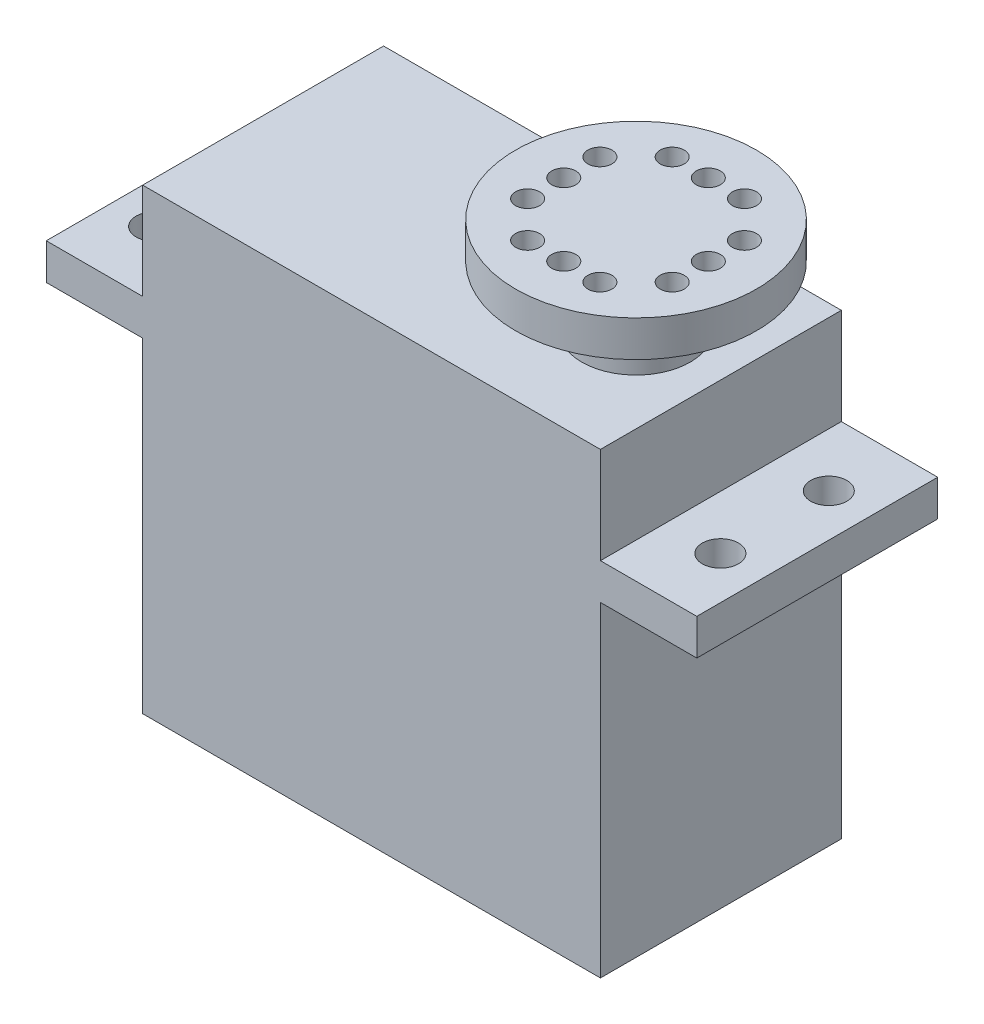
ISO-10303-21;
HEADER;
FILE_DESCRIPTION(('STEP AP214'),'2;1');
FILE_NAME('part.step','',(''),(''),'','','');
FILE_SCHEMA(('AUTOMOTIVE_DESIGN { 1 0 10303 214 1 1 1 1 }'));
ENDSEC;
DATA;
#1=APPLICATION_CONTEXT('core data for automotive mechanical design processes');
#2=APPLICATION_PROTOCOL_DEFINITION('international standard','automotive_design',2000,#1);
#3=PRODUCT_CONTEXT('',#1,'mechanical');
#4=PRODUCT('Part','Part','',(#3));
#5=PRODUCT_RELATED_PRODUCT_CATEGORY('part','',(#4));
#6=PRODUCT_DEFINITION_FORMATION('','',#4);
#7=PRODUCT_DEFINITION_CONTEXT('part definition',#1,'design');
#8=PRODUCT_DEFINITION('design','',#6,#7);
#9=PRODUCT_DEFINITION_SHAPE('','',#8);
#10=(LENGTH_UNIT() NAMED_UNIT(*) SI_UNIT(.MILLI.,.METRE.));
#11=(NAMED_UNIT(*) PLANE_ANGLE_UNIT() SI_UNIT($,.RADIAN.));
#12=(NAMED_UNIT(*) SI_UNIT($,.STERADIAN.) SOLID_ANGLE_UNIT());
#13=UNCERTAINTY_MEASURE_WITH_UNIT(LENGTH_MEASURE(1.E-05),#10,'distance_accuracy_value','');
#14=(GEOMETRIC_REPRESENTATION_CONTEXT(3) GLOBAL_UNCERTAINTY_ASSIGNED_CONTEXT((#13)) GLOBAL_UNIT_ASSIGNED_CONTEXT((#10,
#11,#12)) REPRESENTATION_CONTEXT('',''));
#15=CARTESIAN_POINT('',(0.,0.,0.));
#16=DIRECTION('',(0.,0.,1.));
#17=DIRECTION('',(1.,0.,0.));
#18=AXIS2_PLACEMENT_3D('',#15,#16,#17);
#19=CARTESIAN_POINT('',(38.,0.,20.));
#20=DIRECTION('',(-1.,0.,0.));
#21=DIRECTION('',(0.,0.,1.));
#22=AXIS2_PLACEMENT_3D('',#19,#20,#21);
#23=PLANE('',#22);
#24=DIRECTION('',(0.,1.,0.));
#25=VECTOR('',#24,1.);
#26=CARTESIAN_POINT('',(38.,0.,0.));
#27=LINE('',#26,#25);
#28=CARTESIAN_POINT('',(38.,0.,0.));
#29=VERTEX_POINT('',#28);
#30=CARTESIAN_POINT('',(38.,27.,0.));
#31=VERTEX_POINT('',#30);
#32=EDGE_CURVE('E156',#29,#31,#27,.T.);
#33=ORIENTED_EDGE('',*,*,#32,.T.);
#34=DIRECTION('',(0.,0.,-1.));
#35=VECTOR('',#34,1.);
#36=CARTESIAN_POINT('',(38.,27.,20.));
#37=LINE('',#36,#35);
#38=CARTESIAN_POINT('',(38.,27.,20.));
#39=VERTEX_POINT('',#38);
#40=EDGE_CURVE('E11',#39,#31,#37,.T.);
#41=ORIENTED_EDGE('',*,*,#40,.F.);
#42=DIRECTION('',(0.,1.,0.));
#43=VECTOR('',#42,1.);
#44=CARTESIAN_POINT('',(38.,0.,20.));
#45=LINE('',#44,#43);
#46=CARTESIAN_POINT('',(38.,0.,20.));
#47=VERTEX_POINT('',#46);
#48=EDGE_CURVE('E187',#47,#39,#45,.T.);
#49=ORIENTED_EDGE('',*,*,#48,.F.);
#50=DIRECTION('',(0.,0.,-1.));
#51=VECTOR('',#50,1.);
#52=CARTESIAN_POINT('',(38.,0.,20.));
#53=LINE('',#52,#51);
#54=EDGE_CURVE('E152',#47,#29,#53,.T.);
#55=ORIENTED_EDGE('',*,*,#54,.T.);
#56=EDGE_LOOP('',(#33,#41,#49,#55));
#57=FACE_BOUND('',#56,.T.);
#58=ADVANCED_FACE('F34',(#57),#23,.F.);
#59=CARTESIAN_POINT('',(0.,27.,20.));
#60=DIRECTION('',(0.,1.,0.));
#61=DIRECTION('',(0.,0.,1.));
#62=AXIS2_PLACEMENT_3D('',#59,#60,#61);
#63=PLANE('',#62);
#64=CARTESIAN_POINT('',(42.4562798977896,27.,5.5));
#65=DIRECTION('',(0.,1.,0.));
#66=DIRECTION('',(0.,0.,1.));
#67=AXIS2_PLACEMENT_3D('',#64,#65,#66);
#68=CIRCLE('',#67,1.5);
#69=CARTESIAN_POINT('',(42.4562798977896,27.,7.));
#70=VERTEX_POINT('',#69);
#71=EDGE_CURVE('E222',#70,#70,#68,.T.);
#72=ORIENTED_EDGE('',*,*,#71,.T.);
#73=EDGE_LOOP('',(#72));
#74=FACE_BOUND('',#73,.T.);
#75=CARTESIAN_POINT('',(42.4562798977896,27.,14.5));
#76=DIRECTION('',(0.,1.,0.));
#77=DIRECTION('',(0.,0.,1.));
#78=AXIS2_PLACEMENT_3D('',#75,#76,#77);
#79=CIRCLE('',#78,1.5);
#80=CARTESIAN_POINT('',(42.4562798977896,27.,16.));
#81=VERTEX_POINT('',#80);
#82=EDGE_CURVE('E209',#81,#81,#79,.T.);
#83=ORIENTED_EDGE('',*,*,#82,.T.);
#84=EDGE_LOOP('',(#83));
#85=FACE_BOUND('',#84,.T.);
#86=DIRECTION('',(1.,0.,0.));
#87=VECTOR('',#86,1.);
#88=CARTESIAN_POINT('',(0.,27.,0.));
#89=LINE('',#88,#87);
#90=CARTESIAN_POINT('',(46.,27.,0.));
#91=VERTEX_POINT('',#90);
#92=EDGE_CURVE('E159',#31,#91,#89,.T.);
#93=ORIENTED_EDGE('',*,*,#92,.T.);
#94=DIRECTION('',(0.,0.,-1.));
#95=VECTOR('',#94,1.);
#96=CARTESIAN_POINT('',(46.,27.,20.));
#97=LINE('',#96,#95);
#98=CARTESIAN_POINT('',(46.,27.,20.));
#99=VERTEX_POINT('',#98);
#100=EDGE_CURVE('E43',#99,#91,#97,.T.);
#101=ORIENTED_EDGE('',*,*,#100,.F.);
#102=DIRECTION('',(1.,0.,0.));
#103=VECTOR('',#102,1.);
#104=CARTESIAN_POINT('',(0.,27.,20.));
#105=LINE('',#104,#103);
#106=EDGE_CURVE('E103',#39,#99,#105,.T.);
#107=ORIENTED_EDGE('',*,*,#106,.F.);
#108=ORIENTED_EDGE('',*,*,#40,.T.);
#109=EDGE_LOOP('',(#93,#101,#107,#108));
#110=FACE_BOUND('',#109,.T.);
#111=ADVANCED_FACE('F280',(#74,#85,#110),#63,.F.);
#112=CARTESIAN_POINT('',(46.,0.,20.));
#113=DIRECTION('',(1.,0.,0.));
#114=DIRECTION('',(0.,0.,-1.));
#115=AXIS2_PLACEMENT_3D('',#112,#113,#114);
#116=PLANE('',#115);
#117=DIRECTION('',(0.,-1.,0.));
#118=VECTOR('',#117,1.);
#119=CARTESIAN_POINT('',(46.,0.,0.));
#120=LINE('',#119,#118);
#121=CARTESIAN_POINT('',(46.,30.,0.));
#122=VERTEX_POINT('',#121);
#123=EDGE_CURVE('E163',#122,#91,#120,.T.);
#124=ORIENTED_EDGE('',*,*,#123,.F.);
#125=DIRECTION('',(0.,0.,-1.));
#126=VECTOR('',#125,1.);
#127=CARTESIAN_POINT('',(46.,30.,20.));
#128=LINE('',#127,#126);
#129=CARTESIAN_POINT('',(46.,30.,20.));
#130=VERTEX_POINT('',#129);
#131=EDGE_CURVE('E201',#130,#122,#128,.T.);
#132=ORIENTED_EDGE('',*,*,#131,.F.);
#133=DIRECTION('',(0.,-1.,0.));
#134=VECTOR('',#133,1.);
#135=CARTESIAN_POINT('',(46.,0.,20.));
#136=LINE('',#135,#134);
#137=EDGE_CURVE('E238',#130,#99,#136,.T.);
#138=ORIENTED_EDGE('',*,*,#137,.T.);
#139=ORIENTED_EDGE('',*,*,#100,.T.);
#140=EDGE_LOOP('',(#124,#132,#138,#139));
#141=FACE_BOUND('',#140,.T.);
#142=ADVANCED_FACE('F285',(#141),#116,.T.);
#143=CARTESIAN_POINT('',(0.,30.,20.));
#144=DIRECTION('',(0.,1.,0.));
#145=DIRECTION('',(0.,0.,1.));
#146=AXIS2_PLACEMENT_3D('',#143,#144,#145);
#147=PLANE('',#146);
#148=CARTESIAN_POINT('',(42.4562798977896,30.,5.5));
#149=DIRECTION('',(0.,1.,0.));
#150=DIRECTION('',(0.,0.,1.));
#151=AXIS2_PLACEMENT_3D('',#148,#149,#150);
#152=CIRCLE('',#151,1.5);
#153=CARTESIAN_POINT('',(42.4562798977896,30.,7.));
#154=VERTEX_POINT('',#153);
#155=EDGE_CURVE('E211',#154,#154,#152,.T.);
#156=ORIENTED_EDGE('',*,*,#155,.F.);
#157=EDGE_LOOP('',(#156));
#158=FACE_BOUND('',#157,.T.);
#159=CARTESIAN_POINT('',(42.4562798977896,30.,14.5));
#160=DIRECTION('',(0.,1.,0.));
#161=DIRECTION('',(0.,0.,1.));
#162=AXIS2_PLACEMENT_3D('',#159,#160,#161);
#163=CIRCLE('',#162,1.5);
#164=CARTESIAN_POINT('',(42.4562798977896,30.,16.));
#165=VERTEX_POINT('',#164);
#166=EDGE_CURVE('E205',#165,#165,#163,.T.);
#167=ORIENTED_EDGE('',*,*,#166,.F.);
#168=EDGE_LOOP('',(#167));
#169=FACE_BOUND('',#168,.T.);
#170=DIRECTION('',(1.,0.,0.));
#171=VECTOR('',#170,1.);
#172=CARTESIAN_POINT('',(0.,30.,0.));
#173=LINE('',#172,#171);
#174=CARTESIAN_POINT('',(38.,30.,0.));
#175=VERTEX_POINT('',#174);
#176=EDGE_CURVE('E166',#175,#122,#173,.T.);
#177=ORIENTED_EDGE('',*,*,#176,.F.);
#178=DIRECTION('',(0.,0.,-1.));
#179=VECTOR('',#178,1.);
#180=CARTESIAN_POINT('',(38.,30.,20.));
#181=LINE('',#180,#179);
#182=CARTESIAN_POINT('',(38.,30.,20.));
#183=VERTEX_POINT('',#182);
#184=EDGE_CURVE('E199',#183,#175,#181,.T.);
#185=ORIENTED_EDGE('',*,*,#184,.F.);
#186=DIRECTION('',(1.,0.,0.));
#187=VECTOR('',#186,1.);
#188=CARTESIAN_POINT('',(0.,30.,20.));
#189=LINE('',#188,#187);
#190=EDGE_CURVE('E241',#183,#130,#189,.T.);
#191=ORIENTED_EDGE('',*,*,#190,.T.);
#192=ORIENTED_EDGE('',*,*,#131,.T.);
#193=EDGE_LOOP('',(#177,#185,#191,#192));
#194=FACE_BOUND('',#193,.T.);
#195=ADVANCED_FACE('F295',(#158,#169,#194),#147,.T.);
#196=CARTESIAN_POINT('',(38.,0.,20.));
#197=DIRECTION('',(-1.,0.,0.));
#198=DIRECTION('',(0.,0.,1.));
#199=AXIS2_PLACEMENT_3D('',#196,#197,#198);
#200=PLANE('',#199);
#201=DIRECTION('',(0.,1.,0.));
#202=VECTOR('',#201,1.);
#203=CARTESIAN_POINT('',(38.,0.,0.));
#204=LINE('',#203,#202);
#205=CARTESIAN_POINT('',(38.,38.,0.));
#206=VERTEX_POINT('',#205);
#207=EDGE_CURVE('E169',#175,#206,#204,.T.);
#208=ORIENTED_EDGE('',*,*,#207,.T.);
#209=DIRECTION('',(0.,0.,-1.));
#210=VECTOR('',#209,1.);
#211=CARTESIAN_POINT('',(38.,38.,20.));
#212=LINE('',#211,#210);
#213=CARTESIAN_POINT('',(38.,38.,20.));
#214=VERTEX_POINT('',#213);
#215=EDGE_CURVE('E197',#214,#206,#212,.T.);
#216=ORIENTED_EDGE('',*,*,#215,.F.);
#217=DIRECTION('',(0.,1.,0.));
#218=VECTOR('',#217,1.);
#219=CARTESIAN_POINT('',(38.,0.,20.));
#220=LINE('',#219,#218);
#221=EDGE_CURVE('E244',#183,#214,#220,.T.);
#222=ORIENTED_EDGE('',*,*,#221,.F.);
#223=ORIENTED_EDGE('',*,*,#184,.T.);
#224=EDGE_LOOP('',(#208,#216,#222,#223));
#225=FACE_BOUND('',#224,.T.);
#226=ADVANCED_FACE('F300',(#225),#200,.F.);
#227=CARTESIAN_POINT('',(0.,38.,20.));
#228=DIRECTION('',(0.,1.,0.));
#229=DIRECTION('',(0.,0.,1.));
#230=AXIS2_PLACEMENT_3D('',#227,#228,#229);
#231=PLANE('',#230);
#232=CARTESIAN_POINT('',(30.9562798977896,38.,10.));
#233=DIRECTION('',(0.,1.,0.));
#234=DIRECTION('',(0.,0.,1.));
#235=AXIS2_PLACEMENT_3D('',#232,#233,#234);
#236=CIRCLE('',#235,4.5);
#237=CARTESIAN_POINT('',(30.9562798977896,38.,14.5));
#238=VERTEX_POINT('',#237);
#239=EDGE_CURVE('E229',#238,#238,#236,.T.);
#240=ORIENTED_EDGE('',*,*,#239,.F.);
#241=EDGE_LOOP('',(#240));
#242=FACE_BOUND('',#241,.T.);
#243=DIRECTION('',(1.,0.,0.));
#244=VECTOR('',#243,1.);
#245=CARTESIAN_POINT('',(0.,38.,0.));
#246=LINE('',#245,#244);
#247=CARTESIAN_POINT('',(0.,38.,0.));
#248=VERTEX_POINT('',#247);
#249=EDGE_CURVE('E172',#248,#206,#246,.T.);
#250=ORIENTED_EDGE('',*,*,#249,.F.);
#251=DIRECTION('',(0.,0.,-1.));
#252=VECTOR('',#251,1.);
#253=CARTESIAN_POINT('',(0.,38.,20.));
#254=LINE('',#253,#252);
#255=CARTESIAN_POINT('',(0.,38.,20.));
#256=VERTEX_POINT('',#255);
#257=EDGE_CURVE('E195',#256,#248,#254,.T.);
#258=ORIENTED_EDGE('',*,*,#257,.F.);
#259=DIRECTION('',(1.,0.,0.));
#260=VECTOR('',#259,1.);
#261=CARTESIAN_POINT('',(0.,38.,20.));
#262=LINE('',#261,#260);
#263=EDGE_CURVE('E246',#256,#214,#262,.T.);
#264=ORIENTED_EDGE('',*,*,#263,.T.);
#265=ORIENTED_EDGE('',*,*,#215,.T.);
#266=EDGE_LOOP('',(#250,#258,#264,#265));
#267=FACE_BOUND('',#266,.T.);
#268=ADVANCED_FACE('F302',(#242,#267),#231,.T.);
#269=CARTESIAN_POINT('',(0.,0.,20.));
#270=DIRECTION('',(-1.,0.,0.));
#271=DIRECTION('',(0.,0.,1.));
#272=AXIS2_PLACEMENT_3D('',#269,#270,#271);
#273=PLANE('',#272);
#274=DIRECTION('',(0.,1.,0.));
#275=VECTOR('',#274,1.);
#276=CARTESIAN_POINT('',(0.,0.,0.));
#277=LINE('',#276,#275);
#278=CARTESIAN_POINT('',(0.,30.,0.));
#279=VERTEX_POINT('',#278);
#280=EDGE_CURVE('E175',#279,#248,#277,.T.);
#281=ORIENTED_EDGE('',*,*,#280,.F.);
#282=DIRECTION('',(0.,0.,-1.));
#283=VECTOR('',#282,1.);
#284=CARTESIAN_POINT('',(0.,30.,20.));
#285=LINE('',#284,#283);
#286=CARTESIAN_POINT('',(0.,30.,20.));
#287=VERTEX_POINT('',#286);
#288=EDGE_CURVE('E193',#287,#279,#285,.T.);
#289=ORIENTED_EDGE('',*,*,#288,.F.);
#290=DIRECTION('',(0.,1.,0.));
#291=VECTOR('',#290,1.);
#292=CARTESIAN_POINT('',(0.,0.,20.));
#293=LINE('',#292,#291);
#294=EDGE_CURVE('E249',#287,#256,#293,.T.);
#295=ORIENTED_EDGE('',*,*,#294,.T.);
#296=ORIENTED_EDGE('',*,*,#257,.T.);
#297=EDGE_LOOP('',(#281,#289,#295,#296));
#298=FACE_BOUND('',#297,.T.);
#299=ADVANCED_FACE('F261',(#298),#273,.T.);
#300=CARTESIAN_POINT('',(0.,30.,20.));
#301=DIRECTION('',(0.,1.,0.));
#302=DIRECTION('',(0.,0.,1.));
#303=AXIS2_PLACEMENT_3D('',#300,#301,#302);
#304=PLANE('',#303);
#305=CARTESIAN_POINT('',(-4.5437201022104,30.,14.5));
#306=DIRECTION('',(0.,1.,0.));
#307=DIRECTION('',(0.,0.,1.));
#308=AXIS2_PLACEMENT_3D('',#305,#306,#307);
#309=CIRCLE('',#308,1.5);
#310=CARTESIAN_POINT('',(-4.5437201022104,30.,16.));
#311=VERTEX_POINT('',#310);
#312=EDGE_CURVE('E216',#311,#311,#309,.T.);
#313=ORIENTED_EDGE('',*,*,#312,.F.);
#314=EDGE_LOOP('',(#313));
#315=FACE_BOUND('',#314,.T.);
#316=CARTESIAN_POINT('',(-4.5437201022104,30.,5.49999999999999));
#317=DIRECTION('',(0.,1.,0.));
#318=DIRECTION('',(0.,0.,1.));
#319=AXIS2_PLACEMENT_3D('',#316,#317,#318);
#320=CIRCLE('',#319,1.5);
#321=CARTESIAN_POINT('',(-4.5437201022104,30.,6.99999999999999));
#322=VERTEX_POINT('',#321);
#323=EDGE_CURVE('E656',#322,#322,#320,.T.);
#324=ORIENTED_EDGE('',*,*,#323,.F.);
#325=EDGE_LOOP('',(#324));
#326=FACE_BOUND('',#325,.T.);
#327=DIRECTION('',(1.,0.,0.));
#328=VECTOR('',#327,1.);
#329=CARTESIAN_POINT('',(0.,30.,0.));
#330=LINE('',#329,#328);
#331=CARTESIAN_POINT('',(-8.,30.,0.));
#332=VERTEX_POINT('',#331);
#333=EDGE_CURVE('E178',#332,#279,#330,.T.);
#334=ORIENTED_EDGE('',*,*,#333,.F.);
#335=DIRECTION('',(0.,0.,-1.));
#336=VECTOR('',#335,1.);
#337=CARTESIAN_POINT('',(-8.,30.,20.));
#338=LINE('',#337,#336);
#339=CARTESIAN_POINT('',(-8.,30.,20.));
#340=VERTEX_POINT('',#339);
#341=EDGE_CURVE('E191',#340,#332,#338,.T.);
#342=ORIENTED_EDGE('',*,*,#341,.F.);
#343=DIRECTION('',(1.,0.,0.));
#344=VECTOR('',#343,1.);
#345=CARTESIAN_POINT('',(0.,30.,20.));
#346=LINE('',#345,#344);
#347=EDGE_CURVE('E252',#340,#287,#346,.T.);
#348=ORIENTED_EDGE('',*,*,#347,.T.);
#349=ORIENTED_EDGE('',*,*,#288,.T.);
#350=EDGE_LOOP('',(#334,#342,#348,#349));
#351=FACE_BOUND('',#350,.T.);
#352=ADVANCED_FACE('F256',(#315,#326,#351),#304,.T.);
#353=CARTESIAN_POINT('',(-8.,0.,20.));
#354=DIRECTION('',(1.,0.,0.));
#355=DIRECTION('',(0.,0.,-1.));
#356=AXIS2_PLACEMENT_3D('',#353,#354,#355);
#357=PLANE('',#356);
#358=DIRECTION('',(0.,-1.,0.));
#359=VECTOR('',#358,1.);
#360=CARTESIAN_POINT('',(-8.,0.,0.));
#361=LINE('',#360,#359);
#362=CARTESIAN_POINT('',(-8.,27.,0.));
#363=VERTEX_POINT('',#362);
#364=EDGE_CURVE('E181',#332,#363,#361,.T.);
#365=ORIENTED_EDGE('',*,*,#364,.T.);
#366=DIRECTION('',(0.,0.,-1.));
#367=VECTOR('',#366,1.);
#368=CARTESIAN_POINT('',(-8.,27.,20.));
#369=LINE('',#368,#367);
#370=CARTESIAN_POINT('',(-8.,27.,20.));
#371=VERTEX_POINT('',#370);
#372=EDGE_CURVE('E148',#371,#363,#369,.T.);
#373=ORIENTED_EDGE('',*,*,#372,.F.);
#374=DIRECTION('',(0.,-1.,0.));
#375=VECTOR('',#374,1.);
#376=CARTESIAN_POINT('',(-8.,0.,20.));
#377=LINE('',#376,#375);
#378=EDGE_CURVE('E135',#340,#371,#377,.T.);
#379=ORIENTED_EDGE('',*,*,#378,.F.);
#380=ORIENTED_EDGE('',*,*,#341,.T.);
#381=EDGE_LOOP('',(#365,#373,#379,#380));
#382=FACE_BOUND('',#381,.T.);
#383=ADVANCED_FACE('F268',(#382),#357,.F.);
#384=CARTESIAN_POINT('',(0.,27.,20.));
#385=DIRECTION('',(0.,1.,0.));
#386=DIRECTION('',(0.,0.,1.));
#387=AXIS2_PLACEMENT_3D('',#384,#385,#386);
#388=PLANE('',#387);
#389=CARTESIAN_POINT('',(-4.5437201022104,27.,14.5));
#390=DIRECTION('',(0.,1.,0.));
#391=DIRECTION('',(0.,0.,1.));
#392=AXIS2_PLACEMENT_3D('',#389,#390,#391);
#393=CIRCLE('',#392,1.5);
#394=CARTESIAN_POINT('',(-4.5437201022104,27.,16.));
#395=VERTEX_POINT('',#394);
#396=EDGE_CURVE('E37',#395,#395,#393,.T.);
#397=ORIENTED_EDGE('',*,*,#396,.T.);
#398=EDGE_LOOP('',(#397));
#399=FACE_BOUND('',#398,.T.);
#400=CARTESIAN_POINT('',(-4.5437201022104,27.,5.49999999999999));
#401=DIRECTION('',(0.,1.,0.));
#402=DIRECTION('',(0.,0.,1.));
#403=AXIS2_PLACEMENT_3D('',#400,#401,#402);
#404=CIRCLE('',#403,1.5);
#405=CARTESIAN_POINT('',(-4.5437201022104,27.,6.99999999999999));
#406=VERTEX_POINT('',#405);
#407=EDGE_CURVE('E203',#406,#406,#404,.T.);
#408=ORIENTED_EDGE('',*,*,#407,.T.);
#409=EDGE_LOOP('',(#408));
#410=FACE_BOUND('',#409,.T.);
#411=DIRECTION('',(1.,0.,0.));
#412=VECTOR('',#411,1.);
#413=CARTESIAN_POINT('',(0.,27.,0.));
#414=LINE('',#413,#412);
#415=CARTESIAN_POINT('',(0.,27.,0.));
#416=VERTEX_POINT('',#415);
#417=EDGE_CURVE('E144',#363,#416,#414,.T.);
#418=ORIENTED_EDGE('',*,*,#417,.T.);
#419=DIRECTION('',(0.,0.,-1.));
#420=VECTOR('',#419,1.);
#421=CARTESIAN_POINT('',(0.,27.,20.));
#422=LINE('',#421,#420);
#423=CARTESIAN_POINT('',(0.,27.,20.));
#424=VERTEX_POINT('',#423);
#425=EDGE_CURVE('E141',#424,#416,#422,.T.);
#426=ORIENTED_EDGE('',*,*,#425,.F.);
#427=DIRECTION('',(1.,0.,0.));
#428=VECTOR('',#427,1.);
#429=CARTESIAN_POINT('',(0.,27.,20.));
#430=LINE('',#429,#428);
#431=EDGE_CURVE('E128',#371,#424,#430,.T.);
#432=ORIENTED_EDGE('',*,*,#431,.F.);
#433=ORIENTED_EDGE('',*,*,#372,.T.);
#434=EDGE_LOOP('',(#418,#426,#432,#433));
#435=FACE_BOUND('',#434,.T.);
#436=ADVANCED_FACE('F142',(#399,#410,#435),#388,.F.);
#437=CARTESIAN_POINT('',(0.,0.,20.));
#438=DIRECTION('',(-1.,0.,0.));
#439=DIRECTION('',(0.,0.,1.));
#440=AXIS2_PLACEMENT_3D('',#437,#438,#439);
#441=PLANE('',#440);
#442=DIRECTION('',(0.,1.,0.));
#443=VECTOR('',#442,1.);
#444=CARTESIAN_POINT('',(0.,0.,0.));
#445=LINE('',#444,#443);
#446=CARTESIAN_POINT('',(0.,0.,0.));
#447=VERTEX_POINT('',#446);
#448=EDGE_CURVE('E184',#447,#416,#445,.T.);
#449=ORIENTED_EDGE('',*,*,#448,.F.);
#450=DIRECTION('',(0.,0.,-1.));
#451=VECTOR('',#450,1.);
#452=CARTESIAN_POINT('',(0.,0.,20.));
#453=LINE('',#452,#451);
#454=CARTESIAN_POINT('',(0.,0.,20.));
#455=VERTEX_POINT('',#454);
#456=EDGE_CURVE('E92',#455,#447,#453,.T.);
#457=ORIENTED_EDGE('',*,*,#456,.F.);
#458=DIRECTION('',(0.,1.,0.));
#459=VECTOR('',#458,1.);
#460=CARTESIAN_POINT('',(0.,0.,20.));
#461=LINE('',#460,#459);
#462=EDGE_CURVE('E132',#455,#424,#461,.T.);
#463=ORIENTED_EDGE('',*,*,#462,.T.);
#464=ORIENTED_EDGE('',*,*,#425,.T.);
#465=EDGE_LOOP('',(#449,#457,#463,#464));
#466=FACE_BOUND('',#465,.T.);
#467=ADVANCED_FACE('F150',(#466),#441,.T.);
#468=CARTESIAN_POINT('',(0.,0.,20.));
#469=DIRECTION('',(0.,1.,0.));
#470=DIRECTION('',(0.,0.,1.));
#471=AXIS2_PLACEMENT_3D('',#468,#469,#470);
#472=PLANE('',#471);
#473=DIRECTION('',(1.,0.,0.));
#474=VECTOR('',#473,1.);
#475=CARTESIAN_POINT('',(0.,0.,0.));
#476=LINE('',#475,#474);
#477=EDGE_CURVE('E95',#447,#29,#476,.T.);
#478=ORIENTED_EDGE('',*,*,#477,.T.);
#479=ORIENTED_EDGE('',*,*,#54,.F.);
#480=DIRECTION('',(1.,0.,0.));
#481=VECTOR('',#480,1.);
#482=CARTESIAN_POINT('',(0.,0.,20.));
#483=LINE('',#482,#481);
#484=EDGE_CURVE('E52',#455,#47,#483,.T.);
#485=ORIENTED_EDGE('',*,*,#484,.F.);
#486=ORIENTED_EDGE('',*,*,#456,.T.);
#487=EDGE_LOOP('',(#478,#479,#485,#486));
#488=FACE_BOUND('',#487,.T.);
#489=ADVANCED_FACE('F353',(#488),#472,.F.);
#490=CARTESIAN_POINT('',(0.,0.,20.));
#491=DIRECTION('',(0.,0.,1.));
#492=DIRECTION('',(1.,0.,0.));
#493=AXIS2_PLACEMENT_3D('',#490,#491,#492);
#494=PLANE('',#493);
#495=ORIENTED_EDGE('',*,*,#48,.T.);
#496=ORIENTED_EDGE('',*,*,#106,.T.);
#497=ORIENTED_EDGE('',*,*,#137,.F.);
#498=ORIENTED_EDGE('',*,*,#190,.F.);
#499=ORIENTED_EDGE('',*,*,#221,.T.);
#500=ORIENTED_EDGE('',*,*,#263,.F.);
#501=ORIENTED_EDGE('',*,*,#294,.F.);
#502=ORIENTED_EDGE('',*,*,#347,.F.);
#503=ORIENTED_EDGE('',*,*,#378,.T.);
#504=ORIENTED_EDGE('',*,*,#431,.T.);
#505=ORIENTED_EDGE('',*,*,#462,.F.);
#506=ORIENTED_EDGE('',*,*,#484,.T.);
#507=EDGE_LOOP('',(#495,#496,#497,#498,#499,#500,#501,#502,#503,#504,#505,#506));
#508=FACE_BOUND('',#507,.T.);
#509=ADVANCED_FACE('F130',(#508),#494,.T.);
#510=CARTESIAN_POINT('',(0.,0.,0.));
#511=DIRECTION('',(0.,0.,1.));
#512=DIRECTION('',(1.,0.,0.));
#513=AXIS2_PLACEMENT_3D('',#510,#511,#512);
#514=PLANE('',#513);
#515=ORIENTED_EDGE('',*,*,#32,.F.);
#516=ORIENTED_EDGE('',*,*,#477,.F.);
#517=ORIENTED_EDGE('',*,*,#448,.T.);
#518=ORIENTED_EDGE('',*,*,#417,.F.);
#519=ORIENTED_EDGE('',*,*,#364,.F.);
#520=ORIENTED_EDGE('',*,*,#333,.T.);
#521=ORIENTED_EDGE('',*,*,#280,.T.);
#522=ORIENTED_EDGE('',*,*,#249,.T.);
#523=ORIENTED_EDGE('',*,*,#207,.F.);
#524=ORIENTED_EDGE('',*,*,#176,.T.);
#525=ORIENTED_EDGE('',*,*,#123,.T.);
#526=ORIENTED_EDGE('',*,*,#92,.F.);
#527=EDGE_LOOP('',(#515,#516,#517,#518,#519,#520,#521,#522,#523,#524,#525,#526));
#528=FACE_BOUND('',#527,.T.);
#529=ADVANCED_FACE('F266',(#528),#514,.F.);
#530=CARTESIAN_POINT('',(30.9562798977896,43.,10.));
#531=DIRECTION('',(0.,-1.,0.));
#532=DIRECTION('',(0.,0.,-1.));
#533=AXIS2_PLACEMENT_3D('',#530,#531,#532);
#534=CYLINDRICAL_SURFACE('',#533,4.5);
#535=CARTESIAN_POINT('',(30.9562798977896,43.,10.));
#536=DIRECTION('',(0.,1.,0.));
#537=DIRECTION('',(0.,0.,1.));
#538=AXIS2_PLACEMENT_3D('',#535,#536,#537);
#539=CIRCLE('',#538,4.5);
#540=CARTESIAN_POINT('',(30.9562798977896,43.,14.5));
#541=VERTEX_POINT('',#540);
#542=EDGE_CURVE('E160',#541,#541,#539,.T.);
#543=ORIENTED_EDGE('',*,*,#542,.F.);
#544=EDGE_LOOP('',(#543));
#545=FACE_BOUND('',#544,.T.);
#546=ORIENTED_EDGE('',*,*,#239,.T.);
#547=EDGE_LOOP('',(#546));
#548=FACE_BOUND('',#547,.T.);
#549=ADVANCED_FACE('F380',(#545,#548),#534,.T.);
#550=CARTESIAN_POINT('',(30.9562798977896,46.,10.));
#551=DIRECTION('',(0.,-1.,0.));
#552=DIRECTION('',(0.,0.,-1.));
#553=AXIS2_PLACEMENT_3D('',#550,#551,#552);
#554=CYLINDRICAL_SURFACE('',#553,10.);
#555=CARTESIAN_POINT('',(30.9562798977896,46.,10.));
#556=DIRECTION('',(0.,1.,0.));
#557=DIRECTION('',(0.,0.,1.));
#558=AXIS2_PLACEMENT_3D('',#555,#556,#557);
#559=CIRCLE('',#558,10.);
#560=CARTESIAN_POINT('',(30.9562798977896,46.,20.));
#561=VERTEX_POINT('',#560);
#562=EDGE_CURVE('E226',#561,#561,#559,.T.);
#563=ORIENTED_EDGE('',*,*,#562,.F.);
#564=EDGE_LOOP('',(#563));
#565=FACE_BOUND('',#564,.T.);
#566=CARTESIAN_POINT('',(30.9562798977896,43.,10.));
#567=DIRECTION('',(0.,1.,0.));
#568=DIRECTION('',(0.,0.,1.));
#569=AXIS2_PLACEMENT_3D('',#566,#567,#568);
#570=CIRCLE('',#569,10.);
#571=CARTESIAN_POINT('',(30.9562798977896,43.,20.));
#572=VERTEX_POINT('',#571);
#573=EDGE_CURVE('E225',#572,#572,#570,.T.);
#574=ORIENTED_EDGE('',*,*,#573,.T.);
#575=EDGE_LOOP('',(#574));
#576=FACE_BOUND('',#575,.T.);
#577=ADVANCED_FACE('F394',(#565,#576),#554,.T.);
#578=CARTESIAN_POINT('',(30.9562798977896,46.,10.));
#579=DIRECTION('',(0.,1.,0.));
#580=DIRECTION('',(0.,0.,1.));
#581=AXIS2_PLACEMENT_3D('',#578,#579,#580);
#582=PLANE('',#581);
#583=CARTESIAN_POINT('',(24.9562798977896,46.,13.));
#584=DIRECTION('',(0.,1.,0.));
#585=DIRECTION('',(1.,0.,0.));
#586=AXIS2_PLACEMENT_3D('',#583,#584,#585);
#587=CIRCLE('',#586,1.);
#588=CARTESIAN_POINT('',(25.9562798977896,46.,13.));
#589=VERTEX_POINT('',#588);
#590=EDGE_CURVE('E603',#589,#589,#587,.T.);
#591=ORIENTED_EDGE('',*,*,#590,.F.);
#592=EDGE_LOOP('',(#591));
#593=FACE_BOUND('',#592,.T.);
#594=CARTESIAN_POINT('',(24.9562798977896,46.,7.00000000000002));
#595=DIRECTION('',(0.,1.,0.));
#596=DIRECTION('',(1.,0.,0.));
#597=AXIS2_PLACEMENT_3D('',#594,#595,#596);
#598=CIRCLE('',#597,0.999999999999998);
#599=CARTESIAN_POINT('',(25.9562798977895,46.,7.00000000000002));
#600=VERTEX_POINT('',#599);
#601=EDGE_CURVE('E607',#600,#600,#598,.T.);
#602=ORIENTED_EDGE('',*,*,#601,.F.);
#603=EDGE_LOOP('',(#602));
#604=FACE_BOUND('',#603,.T.);
#605=CARTESIAN_POINT('',(30.9562798977896,46.,16.));
#606=DIRECTION('',(0.,1.,0.));
#607=DIRECTION('',(0.,0.,-1.));
#608=AXIS2_PLACEMENT_3D('',#605,#606,#607);
#609=CIRCLE('',#608,0.999999999999994);
#610=CARTESIAN_POINT('',(30.9562798977896,46.,15.));
#611=VERTEX_POINT('',#610);
#612=EDGE_CURVE('E619',#611,#611,#609,.T.);
#613=ORIENTED_EDGE('',*,*,#612,.F.);
#614=EDGE_LOOP('',(#613));
#615=FACE_BOUND('',#614,.T.);
#616=CARTESIAN_POINT('',(33.9562798977896,46.,16.));
#617=DIRECTION('',(0.,1.,0.));
#618=DIRECTION('',(0.,0.,-1.));
#619=AXIS2_PLACEMENT_3D('',#616,#617,#618);
#620=CIRCLE('',#619,1.);
#621=CARTESIAN_POINT('',(33.9562798977896,46.,15.));
#622=VERTEX_POINT('',#621);
#623=EDGE_CURVE('E624',#622,#622,#620,.T.);
#624=ORIENTED_EDGE('',*,*,#623,.F.);
#625=EDGE_LOOP('',(#624));
#626=FACE_BOUND('',#625,.T.);
#627=CARTESIAN_POINT('',(36.9562798977896,46.,12.9999999999999));
#628=DIRECTION('',(0.,1.,0.));
#629=DIRECTION('',(-1.,0.,0.));
#630=AXIS2_PLACEMENT_3D('',#627,#628,#629);
#631=CIRCLE('',#630,0.999999999999998);
#632=CARTESIAN_POINT('',(35.9562798977896,46.,12.9999999999999));
#633=VERTEX_POINT('',#632);
#634=EDGE_CURVE('E700',#633,#633,#631,.T.);
#635=ORIENTED_EDGE('',*,*,#634,.F.);
#636=EDGE_LOOP('',(#635));
#637=FACE_BOUND('',#636,.T.);
#638=CARTESIAN_POINT('',(36.9562798977895,46.,6.99999999999994));
#639=DIRECTION('',(0.,1.,0.));
#640=DIRECTION('',(-1.,0.,0.));
#641=AXIS2_PLACEMENT_3D('',#638,#639,#640);
#642=CIRCLE('',#641,1.);
#643=CARTESIAN_POINT('',(35.9562798977895,46.,6.99999999999995));
#644=VERTEX_POINT('',#643);
#645=EDGE_CURVE('E704',#644,#644,#642,.T.);
#646=ORIENTED_EDGE('',*,*,#645,.F.);
#647=EDGE_LOOP('',(#646));
#648=FACE_BOUND('',#647,.T.);
#649=CARTESIAN_POINT('',(36.9562798977896,46.,9.99999999999994));
#650=DIRECTION('',(0.,1.,0.));
#651=DIRECTION('',(-1.,0.,0.));
#652=AXIS2_PLACEMENT_3D('',#649,#650,#651);
#653=CIRCLE('',#652,0.999999999999994);
#654=CARTESIAN_POINT('',(35.9562798977896,46.,9.99999999999995));
#655=VERTEX_POINT('',#654);
#656=EDGE_CURVE('E615',#655,#655,#653,.T.);
#657=ORIENTED_EDGE('',*,*,#656,.F.);
#658=EDGE_LOOP('',(#657));
#659=FACE_BOUND('',#658,.T.);
#660=CARTESIAN_POINT('',(27.9562798977896,46.,16.));
#661=DIRECTION('',(0.,1.,0.));
#662=DIRECTION('',(0.,0.,-1.));
#663=AXIS2_PLACEMENT_3D('',#660,#661,#662);
#664=CIRCLE('',#663,0.999999999999998);
#665=CARTESIAN_POINT('',(27.9562798977896,46.,15.));
#666=VERTEX_POINT('',#665);
#667=EDGE_CURVE('E630',#666,#666,#664,.T.);
#668=ORIENTED_EDGE('',*,*,#667,.F.);
#669=EDGE_LOOP('',(#668));
#670=FACE_BOUND('',#669,.T.);
#671=CARTESIAN_POINT('',(24.9562798977896,46.,10.));
#672=DIRECTION('',(0.,1.,0.));
#673=DIRECTION('',(1.,0.,0.));
#674=AXIS2_PLACEMENT_3D('',#671,#672,#673);
#675=CIRCLE('',#674,0.999999999999994);
#676=CARTESIAN_POINT('',(25.9562798977896,46.,10.));
#677=VERTEX_POINT('',#676);
#678=EDGE_CURVE('E635',#677,#677,#675,.T.);
#679=ORIENTED_EDGE('',*,*,#678,.F.);
#680=EDGE_LOOP('',(#679));
#681=FACE_BOUND('',#680,.T.);
#682=CARTESIAN_POINT('',(33.9562798977896,46.,4.));
#683=DIRECTION('',(0.,1.,0.));
#684=DIRECTION('',(0.,0.,1.));
#685=AXIS2_PLACEMENT_3D('',#682,#683,#684);
#686=CIRCLE('',#685,0.999999999999998);
#687=CARTESIAN_POINT('',(33.9562798977896,46.,5.));
#688=VERTEX_POINT('',#687);
#689=EDGE_CURVE('E643',#688,#688,#686,.T.);
#690=ORIENTED_EDGE('',*,*,#689,.F.);
#691=EDGE_LOOP('',(#690));
#692=FACE_BOUND('',#691,.T.);
#693=CARTESIAN_POINT('',(27.9562798977896,46.,4.));
#694=DIRECTION('',(0.,1.,0.));
#695=DIRECTION('',(0.,0.,1.));
#696=AXIS2_PLACEMENT_3D('',#693,#694,#695);
#697=CIRCLE('',#696,1.);
#698=CARTESIAN_POINT('',(27.9562798977896,46.,5.));
#699=VERTEX_POINT('',#698);
#700=EDGE_CURVE('E642',#699,#699,#697,.T.);
#701=ORIENTED_EDGE('',*,*,#700,.F.);
#702=EDGE_LOOP('',(#701));
#703=FACE_BOUND('',#702,.T.);
#704=CARTESIAN_POINT('',(30.9562798977896,46.,4.));
#705=DIRECTION('',(0.,1.,0.));
#706=DIRECTION('',(0.,0.,1.));
#707=AXIS2_PLACEMENT_3D('',#704,#705,#706);
#708=CIRCLE('',#707,0.999999999999994);
#709=CARTESIAN_POINT('',(30.9562798977896,46.,4.99999999999999));
#710=VERTEX_POINT('',#709);
#711=EDGE_CURVE('E653',#710,#710,#708,.T.);
#712=ORIENTED_EDGE('',*,*,#711,.F.);
#713=EDGE_LOOP('',(#712));
#714=FACE_BOUND('',#713,.T.);
#715=ORIENTED_EDGE('',*,*,#562,.T.);
#716=EDGE_LOOP('',(#715));
#717=FACE_BOUND('',#716,.T.);
#718=ADVANCED_FACE('F403',(#593,#604,#615,#626,#637,#648,#659,#670,#681,#692,#703,#714,#717),
#582,.T.);
#719=CARTESIAN_POINT('',(30.9562798977896,43.,10.));
#720=DIRECTION('',(0.,1.,0.));
#721=DIRECTION('',(0.,0.,1.));
#722=AXIS2_PLACEMENT_3D('',#719,#720,#721);
#723=PLANE('',#722);
#724=CARTESIAN_POINT('',(24.9562798977896,43.,13.));
#725=DIRECTION('',(0.,1.,0.));
#726=DIRECTION('',(0.,0.,1.));
#727=AXIS2_PLACEMENT_3D('',#724,#725,#726);
#728=CIRCLE('',#727,1.);
#729=CARTESIAN_POINT('',(24.9562798977896,43.,14.));
#730=VERTEX_POINT('',#729);
#731=EDGE_CURVE('E606',#730,#730,#728,.F.);
#732=ORIENTED_EDGE('',*,*,#731,.F.);
#733=EDGE_LOOP('',(#732));
#734=FACE_BOUND('',#733,.T.);
#735=CARTESIAN_POINT('',(24.9562798977896,43.,7.00000000000002));
#736=DIRECTION('',(0.,1.,0.));
#737=DIRECTION('',(0.,0.,1.));
#738=AXIS2_PLACEMENT_3D('',#735,#736,#737);
#739=CIRCLE('',#738,0.999999999999998);
#740=CARTESIAN_POINT('',(24.9562798977896,43.,8.00000000000002));
#741=VERTEX_POINT('',#740);
#742=EDGE_CURVE('E612',#741,#741,#739,.F.);
#743=ORIENTED_EDGE('',*,*,#742,.F.);
#744=EDGE_LOOP('',(#743));
#745=FACE_BOUND('',#744,.T.);
#746=CARTESIAN_POINT('',(30.9562798977896,43.,16.));
#747=DIRECTION('',(0.,1.,0.));
#748=DIRECTION('',(0.,0.,1.));
#749=AXIS2_PLACEMENT_3D('',#746,#747,#748);
#750=CIRCLE('',#749,0.999999999999994);
#751=CARTESIAN_POINT('',(30.9562798977896,43.,17.));
#752=VERTEX_POINT('',#751);
#753=EDGE_CURVE('E621',#752,#752,#750,.F.);
#754=ORIENTED_EDGE('',*,*,#753,.F.);
#755=EDGE_LOOP('',(#754));
#756=FACE_BOUND('',#755,.T.);
#757=CARTESIAN_POINT('',(33.9562798977896,43.,16.));
#758=DIRECTION('',(0.,1.,0.));
#759=DIRECTION('',(0.,0.,1.));
#760=AXIS2_PLACEMENT_3D('',#757,#758,#759);
#761=CIRCLE('',#760,1.);
#762=CARTESIAN_POINT('',(33.9562798977896,43.,17.));
#763=VERTEX_POINT('',#762);
#764=EDGE_CURVE('E627',#763,#763,#761,.F.);
#765=ORIENTED_EDGE('',*,*,#764,.F.);
#766=EDGE_LOOP('',(#765));
#767=FACE_BOUND('',#766,.T.);
#768=CARTESIAN_POINT('',(36.9562798977896,43.,12.9999999999999));
#769=DIRECTION('',(0.,1.,0.));
#770=DIRECTION('',(0.,0.,1.));
#771=AXIS2_PLACEMENT_3D('',#768,#769,#770);
#772=CIRCLE('',#771,0.999999999999998);
#773=CARTESIAN_POINT('',(36.9562798977896,43.,13.9999999999999));
#774=VERTEX_POINT('',#773);
#775=EDGE_CURVE('E724',#774,#774,#772,.F.);
#776=ORIENTED_EDGE('',*,*,#775,.F.);
#777=EDGE_LOOP('',(#776));
#778=FACE_BOUND('',#777,.T.);
#779=CARTESIAN_POINT('',(36.9562798977895,43.,6.99999999999994));
#780=DIRECTION('',(0.,1.,0.));
#781=DIRECTION('',(0.,0.,1.));
#782=AXIS2_PLACEMENT_3D('',#779,#780,#781);
#783=CIRCLE('',#782,1.);
#784=CARTESIAN_POINT('',(36.9562798977895,43.,7.99999999999994));
#785=VERTEX_POINT('',#784);
#786=EDGE_CURVE('E719',#785,#785,#783,.F.);
#787=ORIENTED_EDGE('',*,*,#786,.F.);
#788=EDGE_LOOP('',(#787));
#789=FACE_BOUND('',#788,.T.);
#790=CARTESIAN_POINT('',(36.9562798977896,43.,9.99999999999994));
#791=DIRECTION('',(0.,1.,0.));
#792=DIRECTION('',(0.,0.,1.));
#793=AXIS2_PLACEMENT_3D('',#790,#791,#792);
#794=CIRCLE('',#793,0.999999999999994);
#795=CARTESIAN_POINT('',(36.9562798977896,43.,10.9999999999999));
#796=VERTEX_POINT('',#795);
#797=EDGE_CURVE('E715',#796,#796,#794,.F.);
#798=ORIENTED_EDGE('',*,*,#797,.F.);
#799=EDGE_LOOP('',(#798));
#800=FACE_BOUND('',#799,.T.);
#801=CARTESIAN_POINT('',(27.9562798977896,43.,16.));
#802=DIRECTION('',(0.,1.,0.));
#803=DIRECTION('',(0.,0.,1.));
#804=AXIS2_PLACEMENT_3D('',#801,#802,#803);
#805=CIRCLE('',#804,0.999999999999998);
#806=CARTESIAN_POINT('',(27.9562798977896,43.,17.));
#807=VERTEX_POINT('',#806);
#808=EDGE_CURVE('E710',#807,#807,#805,.F.);
#809=ORIENTED_EDGE('',*,*,#808,.F.);
#810=EDGE_LOOP('',(#809));
#811=FACE_BOUND('',#810,.T.);
#812=CARTESIAN_POINT('',(24.9562798977896,43.,10.));
#813=DIRECTION('',(0.,1.,0.));
#814=DIRECTION('',(0.,0.,1.));
#815=AXIS2_PLACEMENT_3D('',#812,#813,#814);
#816=CIRCLE('',#815,0.999999999999994);
#817=CARTESIAN_POINT('',(24.9562798977896,43.,11.));
#818=VERTEX_POINT('',#817);
#819=EDGE_CURVE('E609',#818,#818,#816,.F.);
#820=ORIENTED_EDGE('',*,*,#819,.F.);
#821=EDGE_LOOP('',(#820));
#822=FACE_BOUND('',#821,.T.);
#823=CARTESIAN_POINT('',(33.9562798977896,43.,4.));
#824=DIRECTION('',(0.,1.,0.));
#825=DIRECTION('',(0.,0.,1.));
#826=AXIS2_PLACEMENT_3D('',#823,#824,#825);
#827=CIRCLE('',#826,0.999999999999998);
#828=CARTESIAN_POINT('',(33.9562798977896,43.,5.));
#829=VERTEX_POINT('',#828);
#830=EDGE_CURVE('E638',#829,#829,#827,.F.);
#831=ORIENTED_EDGE('',*,*,#830,.F.);
#832=EDGE_LOOP('',(#831));
#833=FACE_BOUND('',#832,.T.);
#834=CARTESIAN_POINT('',(27.9562798977896,43.,4.));
#835=DIRECTION('',(0.,1.,0.));
#836=DIRECTION('',(0.,0.,1.));
#837=AXIS2_PLACEMENT_3D('',#834,#835,#836);
#838=CIRCLE('',#837,1.);
#839=CARTESIAN_POINT('',(27.9562798977896,43.,5.));
#840=VERTEX_POINT('',#839);
#841=EDGE_CURVE('E639',#840,#840,#838,.F.);
#842=ORIENTED_EDGE('',*,*,#841,.F.);
#843=EDGE_LOOP('',(#842));
#844=FACE_BOUND('',#843,.T.);
#845=CARTESIAN_POINT('',(30.9562798977896,43.,4.));
#846=DIRECTION('',(0.,1.,0.));
#847=DIRECTION('',(0.,0.,1.));
#848=AXIS2_PLACEMENT_3D('',#845,#846,#847);
#849=CIRCLE('',#848,0.999999999999994);
#850=CARTESIAN_POINT('',(30.9562798977896,43.,4.99999999999999));
#851=VERTEX_POINT('',#850);
#852=EDGE_CURVE('E646',#851,#851,#849,.F.);
#853=ORIENTED_EDGE('',*,*,#852,.F.);
#854=EDGE_LOOP('',(#853));
#855=FACE_BOUND('',#854,.T.);
#856=ORIENTED_EDGE('',*,*,#542,.T.);
#857=EDGE_LOOP('',(#856));
#858=FACE_BOUND('',#857,.T.);
#859=ORIENTED_EDGE('',*,*,#573,.F.);
#860=EDGE_LOOP('',(#859));
#861=FACE_BOUND('',#860,.T.);
#862=ADVANCED_FACE('F426',(#734,#745,#756,#767,#778,#789,#800,#811,#822,#833,#844,#855,#858,
#861),#723,.F.);
#863=CARTESIAN_POINT('',(-4.5437201022104,20.,5.49999999999999));
#864=DIRECTION('',(0.,1.,0.));
#865=DIRECTION('',(0.,0.,1.));
#866=AXIS2_PLACEMENT_3D('',#863,#864,#865);
#867=CYLINDRICAL_SURFACE('',#866,1.5);
#868=ORIENTED_EDGE('',*,*,#323,.T.);
#869=EDGE_LOOP('',(#868));
#870=FACE_BOUND('',#869,.T.);
#871=ORIENTED_EDGE('',*,*,#407,.F.);
#872=EDGE_LOOP('',(#871));
#873=FACE_BOUND('',#872,.T.);
#874=ADVANCED_FACE('F434',(#870,#873),#867,.F.);
#875=CARTESIAN_POINT('',(-4.5437201022104,20.,14.5));
#876=DIRECTION('',(0.,1.,0.));
#877=DIRECTION('',(0.,0.,1.));
#878=AXIS2_PLACEMENT_3D('',#875,#876,#877);
#879=CYLINDRICAL_SURFACE('',#878,1.5);
#880=ORIENTED_EDGE('',*,*,#312,.T.);
#881=EDGE_LOOP('',(#880));
#882=FACE_BOUND('',#881,.T.);
#883=ORIENTED_EDGE('',*,*,#396,.F.);
#884=EDGE_LOOP('',(#883));
#885=FACE_BOUND('',#884,.T.);
#886=ADVANCED_FACE('F443',(#882,#885),#879,.F.);
#887=CARTESIAN_POINT('',(42.4562798977896,20.,14.5));
#888=DIRECTION('',(0.,1.,0.));
#889=DIRECTION('',(0.,0.,1.));
#890=AXIS2_PLACEMENT_3D('',#887,#888,#889);
#891=CYLINDRICAL_SURFACE('',#890,1.5);
#892=ORIENTED_EDGE('',*,*,#166,.T.);
#893=EDGE_LOOP('',(#892));
#894=FACE_BOUND('',#893,.T.);
#895=ORIENTED_EDGE('',*,*,#82,.F.);
#896=EDGE_LOOP('',(#895));
#897=FACE_BOUND('',#896,.T.);
#898=ADVANCED_FACE('F452',(#894,#897),#891,.F.);
#899=CARTESIAN_POINT('',(42.4562798977896,20.,5.5));
#900=DIRECTION('',(0.,1.,0.));
#901=DIRECTION('',(0.,0.,1.));
#902=AXIS2_PLACEMENT_3D('',#899,#900,#901);
#903=CYLINDRICAL_SURFACE('',#902,1.5);
#904=ORIENTED_EDGE('',*,*,#155,.T.);
#905=EDGE_LOOP('',(#904));
#906=FACE_BOUND('',#905,.T.);
#907=ORIENTED_EDGE('',*,*,#71,.F.);
#908=EDGE_LOOP('',(#907));
#909=FACE_BOUND('',#908,.T.);
#910=ADVANCED_FACE('F460',(#906,#909),#903,.F.);
#911=CARTESIAN_POINT('',(30.9562798977896,-0.001000000000001,4.));
#912=DIRECTION('',(0.,1.,0.));
#913=DIRECTION('',(0.,0.,1.));
#914=AXIS2_PLACEMENT_3D('',#911,#912,#913);
#915=CYLINDRICAL_SURFACE('',#914,0.999999999999994);
#916=ORIENTED_EDGE('',*,*,#711,.T.);
#917=EDGE_LOOP('',(#916));
#918=FACE_BOUND('',#917,.T.);
#919=ORIENTED_EDGE('',*,*,#852,.T.);
#920=EDGE_LOOP('',(#919));
#921=FACE_BOUND('',#920,.T.);
#922=ADVANCED_FACE('F467',(#918,#921),#915,.F.);
#923=CARTESIAN_POINT('',(27.9562798977896,-0.001000000000001,4.));
#924=DIRECTION('',(0.,1.,0.));
#925=DIRECTION('',(0.,0.,1.));
#926=AXIS2_PLACEMENT_3D('',#923,#924,#925);
#927=CYLINDRICAL_SURFACE('',#926,1.);
#928=ORIENTED_EDGE('',*,*,#700,.T.);
#929=EDGE_LOOP('',(#928));
#930=FACE_BOUND('',#929,.T.);
#931=ORIENTED_EDGE('',*,*,#841,.T.);
#932=EDGE_LOOP('',(#931));
#933=FACE_BOUND('',#932,.T.);
#934=ADVANCED_FACE('F475',(#930,#933),#927,.F.);
#935=CARTESIAN_POINT('',(33.9562798977896,-0.001000000000001,4.));
#936=DIRECTION('',(0.,1.,0.));
#937=DIRECTION('',(0.,0.,1.));
#938=AXIS2_PLACEMENT_3D('',#935,#936,#937);
#939=CYLINDRICAL_SURFACE('',#938,0.999999999999998);
#940=ORIENTED_EDGE('',*,*,#689,.T.);
#941=EDGE_LOOP('',(#940));
#942=FACE_BOUND('',#941,.T.);
#943=ORIENTED_EDGE('',*,*,#830,.T.);
#944=EDGE_LOOP('',(#943));
#945=FACE_BOUND('',#944,.T.);
#946=ADVANCED_FACE('F483',(#942,#945),#939,.F.);
#947=CARTESIAN_POINT('',(24.9562798977896,-0.001000000000001,10.));
#948=DIRECTION('',(0.,1.,0.));
#949=DIRECTION('',(0.,0.,1.));
#950=AXIS2_PLACEMENT_3D('',#947,#948,#949);
#951=CYLINDRICAL_SURFACE('',#950,0.999999999999994);
#952=ORIENTED_EDGE('',*,*,#678,.T.);
#953=EDGE_LOOP('',(#952));
#954=FACE_BOUND('',#953,.T.);
#955=ORIENTED_EDGE('',*,*,#819,.T.);
#956=EDGE_LOOP('',(#955));
#957=FACE_BOUND('',#956,.T.);
#958=ADVANCED_FACE('F490',(#954,#957),#951,.F.);
#959=CARTESIAN_POINT('',(27.9562798977896,-0.001000000000001,16.));
#960=DIRECTION('',(0.,1.,0.));
#961=DIRECTION('',(0.,0.,1.));
#962=AXIS2_PLACEMENT_3D('',#959,#960,#961);
#963=CYLINDRICAL_SURFACE('',#962,0.999999999999998);
#964=ORIENTED_EDGE('',*,*,#667,.T.);
#965=EDGE_LOOP('',(#964));
#966=FACE_BOUND('',#965,.T.);
#967=ORIENTED_EDGE('',*,*,#808,.T.);
#968=EDGE_LOOP('',(#967));
#969=FACE_BOUND('',#968,.T.);
#970=ADVANCED_FACE('F497',(#966,#969),#963,.F.);
#971=CARTESIAN_POINT('',(36.9562798977896,-0.001000000000001,9.99999999999994));
#972=DIRECTION('',(0.,1.,0.));
#973=DIRECTION('',(0.,0.,1.));
#974=AXIS2_PLACEMENT_3D('',#971,#972,#973);
#975=CYLINDRICAL_SURFACE('',#974,0.999999999999994);
#976=ORIENTED_EDGE('',*,*,#656,.T.);
#977=EDGE_LOOP('',(#976));
#978=FACE_BOUND('',#977,.T.);
#979=ORIENTED_EDGE('',*,*,#797,.T.);
#980=EDGE_LOOP('',(#979));
#981=FACE_BOUND('',#980,.T.);
#982=ADVANCED_FACE('F505',(#978,#981),#975,.F.);
#983=CARTESIAN_POINT('',(36.9562798977895,-0.001000000000001,6.99999999999994));
#984=DIRECTION('',(0.,1.,0.));
#985=DIRECTION('',(0.,0.,1.));
#986=AXIS2_PLACEMENT_3D('',#983,#984,#985);
#987=CYLINDRICAL_SURFACE('',#986,1.);
#988=ORIENTED_EDGE('',*,*,#645,.T.);
#989=EDGE_LOOP('',(#988));
#990=FACE_BOUND('',#989,.T.);
#991=ORIENTED_EDGE('',*,*,#786,.T.);
#992=EDGE_LOOP('',(#991));
#993=FACE_BOUND('',#992,.T.);
#994=ADVANCED_FACE('F513',(#990,#993),#987,.F.);
#995=CARTESIAN_POINT('',(36.9562798977896,-0.001000000000001,12.9999999999999));
#996=DIRECTION('',(0.,1.,0.));
#997=DIRECTION('',(0.,0.,1.));
#998=AXIS2_PLACEMENT_3D('',#995,#996,#997);
#999=CYLINDRICAL_SURFACE('',#998,0.999999999999998);
#1000=ORIENTED_EDGE('',*,*,#634,.T.);
#1001=EDGE_LOOP('',(#1000));
#1002=FACE_BOUND('',#1001,.T.);
#1003=ORIENTED_EDGE('',*,*,#775,.T.);
#1004=EDGE_LOOP('',(#1003));
#1005=FACE_BOUND('',#1004,.T.);
#1006=ADVANCED_FACE('F521',(#1002,#1005),#999,.F.);
#1007=CARTESIAN_POINT('',(33.9562798977896,-0.001000000000001,16.));
#1008=DIRECTION('',(0.,1.,0.));
#1009=DIRECTION('',(0.,0.,1.));
#1010=AXIS2_PLACEMENT_3D('',#1007,#1008,#1009);
#1011=CYLINDRICAL_SURFACE('',#1010,1.);
#1012=ORIENTED_EDGE('',*,*,#623,.T.);
#1013=EDGE_LOOP('',(#1012));
#1014=FACE_BOUND('',#1013,.T.);
#1015=ORIENTED_EDGE('',*,*,#764,.T.);
#1016=EDGE_LOOP('',(#1015));
#1017=FACE_BOUND('',#1016,.T.);
#1018=ADVANCED_FACE('F529',(#1014,#1017),#1011,.F.);
#1019=CARTESIAN_POINT('',(30.9562798977896,-0.001000000000001,16.));
#1020=DIRECTION('',(0.,1.,0.));
#1021=DIRECTION('',(0.,0.,1.));
#1022=AXIS2_PLACEMENT_3D('',#1019,#1020,#1021);
#1023=CYLINDRICAL_SURFACE('',#1022,0.999999999999994);
#1024=ORIENTED_EDGE('',*,*,#612,.T.);
#1025=EDGE_LOOP('',(#1024));
#1026=FACE_BOUND('',#1025,.T.);
#1027=ORIENTED_EDGE('',*,*,#753,.T.);
#1028=EDGE_LOOP('',(#1027));
#1029=FACE_BOUND('',#1028,.T.);
#1030=ADVANCED_FACE('F537',(#1026,#1029),#1023,.F.);
#1031=CARTESIAN_POINT('',(24.9562798977896,-0.001000000000001,7.00000000000002));
#1032=DIRECTION('',(0.,1.,0.));
#1033=DIRECTION('',(0.,0.,1.));
#1034=AXIS2_PLACEMENT_3D('',#1031,#1032,#1033);
#1035=CYLINDRICAL_SURFACE('',#1034,0.999999999999998);
#1036=ORIENTED_EDGE('',*,*,#601,.T.);
#1037=EDGE_LOOP('',(#1036));
#1038=FACE_BOUND('',#1037,.T.);
#1039=ORIENTED_EDGE('',*,*,#742,.T.);
#1040=EDGE_LOOP('',(#1039));
#1041=FACE_BOUND('',#1040,.T.);
#1042=ADVANCED_FACE('F545',(#1038,#1041),#1035,.F.);
#1043=CARTESIAN_POINT('',(24.9562798977896,-0.001000000000001,13.));
#1044=DIRECTION('',(0.,1.,0.));
#1045=DIRECTION('',(0.,0.,1.));
#1046=AXIS2_PLACEMENT_3D('',#1043,#1044,#1045);
#1047=CYLINDRICAL_SURFACE('',#1046,1.);
#1048=ORIENTED_EDGE('',*,*,#590,.T.);
#1049=EDGE_LOOP('',(#1048));
#1050=FACE_BOUND('',#1049,.T.);
#1051=ORIENTED_EDGE('',*,*,#731,.T.);
#1052=EDGE_LOOP('',(#1051));
#1053=FACE_BOUND('',#1052,.T.);
#1054=ADVANCED_FACE('F553',(#1050,#1053),#1047,.F.);
#1055=CLOSED_SHELL('',(#58,#111,#142,#195,#226,#268,#299,#352,#383,#436,#467,#489,#509,#529,
#549,#577,#718,#862,#874,#886,#898,#910,#922,#934,#946,#958,#970,#982,#994,#1006,#1018,#1030,
#1042,#1054));
#1056=MANIFOLD_SOLID_BREP('B2',#1055);
#1057=ADVANCED_BREP_SHAPE_REPRESENTATION('',(#18,#1056),#14);
#1058=SHAPE_DEFINITION_REPRESENTATION(#9,#1057);
ENDSEC;
END-ISO-10303-21;
